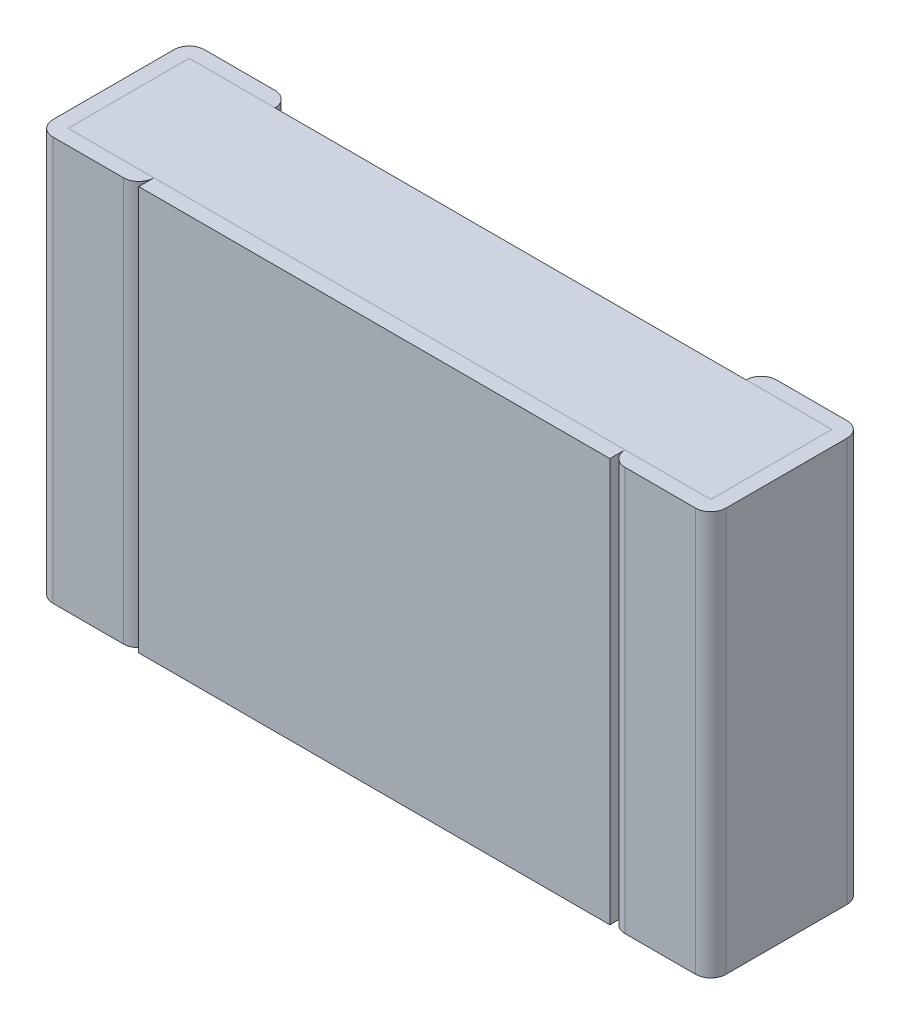
ISO-10303-21;
HEADER;
FILE_DESCRIPTION(('STEP AP214'),'2;1');
FILE_NAME('part.step','',(''),(''),'','','');
FILE_SCHEMA(('AUTOMOTIVE_DESIGN { 1 0 10303 214 1 1 1 1 }'));
ENDSEC;
DATA;
#1=APPLICATION_CONTEXT('core data for automotive mechanical design processes');
#2=APPLICATION_PROTOCOL_DEFINITION('international standard','automotive_design',2000,#1);
#3=PRODUCT_CONTEXT('',#1,'mechanical');
#4=PRODUCT('Part','Part','',(#3));
#5=PRODUCT_RELATED_PRODUCT_CATEGORY('part','',(#4));
#6=PRODUCT_DEFINITION_FORMATION('','',#4);
#7=PRODUCT_DEFINITION_CONTEXT('part definition',#1,'design');
#8=PRODUCT_DEFINITION('design','',#6,#7);
#9=PRODUCT_DEFINITION_SHAPE('','',#8);
#10=(LENGTH_UNIT() NAMED_UNIT(*) SI_UNIT(.MILLI.,.METRE.));
#11=(NAMED_UNIT(*) PLANE_ANGLE_UNIT() SI_UNIT($,.RADIAN.));
#12=(NAMED_UNIT(*) SI_UNIT($,.STERADIAN.) SOLID_ANGLE_UNIT());
#13=UNCERTAINTY_MEASURE_WITH_UNIT(LENGTH_MEASURE(1.E-05),#10,'distance_accuracy_value','');
#14=(GEOMETRIC_REPRESENTATION_CONTEXT(3) GLOBAL_UNCERTAINTY_ASSIGNED_CONTEXT((#13)) GLOBAL_UNIT_ASSIGNED_CONTEXT((#10,
#11,#12)) REPRESENTATION_CONTEXT('',''));
#15=CARTESIAN_POINT('',(0.,0.,0.));
#16=DIRECTION('',(0.,0.,1.));
#17=DIRECTION('',(1.,0.,0.));
#18=AXIS2_PLACEMENT_3D('',#15,#16,#17);
#19=CARTESIAN_POINT('',(-0.7,-0.6,0.45));
#20=DIRECTION('',(0.,0.,1.));
#21=DIRECTION('',(1.,0.,0.));
#22=AXIS2_PLACEMENT_3D('',#19,#20,#21);
#23=PLANE('',#22);
#24=DIRECTION('',(0.,1.,0.));
#25=VECTOR('',#24,1.);
#26=CARTESIAN_POINT('',(-0.7,-0.6,0.45));
#27=LINE('',#26,#25);
#28=CARTESIAN_POINT('',(-0.7,-0.6,0.45));
#29=VERTEX_POINT('',#28);
#30=CARTESIAN_POINT('',(-0.7,0.6,0.45));
#31=VERTEX_POINT('',#30);
#32=EDGE_CURVE('E359',#29,#31,#27,.T.);
#33=ORIENTED_EDGE('',*,*,#32,.F.);
#34=DIRECTION('',(1.,0.,0.));
#35=VECTOR('',#34,1.);
#36=CARTESIAN_POINT('',(-0.7,-0.6,0.45));
#37=LINE('',#36,#35);
#38=CARTESIAN_POINT('',(0.7,-0.6,0.45));
#39=VERTEX_POINT('',#38);
#40=EDGE_CURVE('E341',#29,#39,#37,.T.);
#41=ORIENTED_EDGE('',*,*,#40,.T.);
#42=DIRECTION('',(0.,1.,0.));
#43=VECTOR('',#42,1.);
#44=CARTESIAN_POINT('',(0.7,-0.6,0.45));
#45=LINE('',#44,#43);
#46=CARTESIAN_POINT('',(0.7,0.6,0.45));
#47=VERTEX_POINT('',#46);
#48=EDGE_CURVE('E11',#39,#47,#45,.T.);
#49=ORIENTED_EDGE('',*,*,#48,.T.);
#50=DIRECTION('',(1.,0.,0.));
#51=VECTOR('',#50,1.);
#52=CARTESIAN_POINT('',(-0.7,0.6,0.45));
#53=LINE('',#52,#51);
#54=EDGE_CURVE('E21',#31,#47,#53,.T.);
#55=ORIENTED_EDGE('',*,*,#54,.F.);
#56=EDGE_LOOP('',(#33,#41,#49,#55));
#57=FACE_BOUND('',#56,.T.);
#58=ADVANCED_FACE('F17',(#57),#23,.T.);
#59=CARTESIAN_POINT('',(0.7,-0.6,0.405));
#60=DIRECTION('',(1.,0.,0.));
#61=DIRECTION('',(0.,1.,0.));
#62=AXIS2_PLACEMENT_3D('',#59,#60,#61);
#63=PLANE('',#62);
#64=DIRECTION('',(0.,0.,1.));
#65=VECTOR('',#64,1.);
#66=CARTESIAN_POINT('',(0.7,-0.6,0.405));
#67=LINE('',#66,#65);
#68=CARTESIAN_POINT('',(0.7,-0.6,0.405));
#69=VERTEX_POINT('',#68);
#70=EDGE_CURVE('E304',#69,#39,#67,.T.);
#71=ORIENTED_EDGE('',*,*,#70,.F.);
#72=DIRECTION('',(0.,1.,0.));
#73=VECTOR('',#72,1.);
#74=CARTESIAN_POINT('',(0.7,-0.6,0.405));
#75=LINE('',#74,#73);
#76=CARTESIAN_POINT('',(0.7,0.6,0.405));
#77=VERTEX_POINT('',#76);
#78=EDGE_CURVE('E28',#69,#77,#75,.T.);
#79=ORIENTED_EDGE('',*,*,#78,.T.);
#80=DIRECTION('',(0.,0.,1.));
#81=VECTOR('',#80,1.);
#82=CARTESIAN_POINT('',(0.7,0.6,0.405));
#83=LINE('',#82,#81);
#84=EDGE_CURVE('E417',#77,#47,#83,.T.);
#85=ORIENTED_EDGE('',*,*,#84,.T.);
#86=ORIENTED_EDGE('',*,*,#48,.F.);
#87=EDGE_LOOP('',(#71,#79,#85,#86));
#88=FACE_BOUND('',#87,.T.);
#89=ADVANCED_FACE('F545',(#88),#63,.T.);
#90=CARTESIAN_POINT('',(0.745,-0.6,0.405));
#91=DIRECTION('',(0.,1.,0.));
#92=DIRECTION('',(-1.,0.,0.));
#93=AXIS2_PLACEMENT_3D('',#90,#91,#92);
#94=CYLINDRICAL_SURFACE('',#93,0.045);
#95=CARTESIAN_POINT('',(0.745,-0.6,0.405));
#96=DIRECTION('',(0.,1.,0.));
#97=DIRECTION('',(0.,0.,1.));
#98=AXIS2_PLACEMENT_3D('',#95,#96,#97);
#99=CIRCLE('',#98,0.045);
#100=CARTESIAN_POINT('',(0.745,-0.6,0.45));
#101=VERTEX_POINT('',#100);
#102=EDGE_CURVE('E298',#69,#101,#99,.T.);
#103=ORIENTED_EDGE('',*,*,#102,.T.);
#104=DIRECTION('',(0.,1.,0.));
#105=VECTOR('',#104,1.);
#106=CARTESIAN_POINT('',(0.745,-0.6,0.45));
#107=LINE('',#106,#105);
#108=CARTESIAN_POINT('',(0.745,0.6,0.45));
#109=VERTEX_POINT('',#108);
#110=EDGE_CURVE('E329',#101,#109,#107,.T.);
#111=ORIENTED_EDGE('',*,*,#110,.T.);
#112=CARTESIAN_POINT('',(0.745,0.6,0.405));
#113=DIRECTION('',(0.,1.,0.));
#114=DIRECTION('',(0.,0.,1.));
#115=AXIS2_PLACEMENT_3D('',#112,#113,#114);
#116=CIRCLE('',#115,0.045);
#117=EDGE_CURVE('E293',#77,#109,#116,.T.);
#118=ORIENTED_EDGE('',*,*,#117,.F.);
#119=ORIENTED_EDGE('',*,*,#78,.F.);
#120=EDGE_LOOP('',(#103,#111,#118,#119));
#121=FACE_BOUND('',#120,.T.);
#122=ADVANCED_FACE('F502',(#121),#94,.T.);
#123=CARTESIAN_POINT('',(0.7,-0.6,0.45));
#124=DIRECTION('',(0.,0.,1.));
#125=DIRECTION('',(1.,0.,0.));
#126=AXIS2_PLACEMENT_3D('',#123,#124,#125);
#127=PLANE('',#126);
#128=DIRECTION('',(1.,0.,0.));
#129=VECTOR('',#128,1.);
#130=CARTESIAN_POINT('',(0.7,0.6,0.45));
#131=LINE('',#130,#129);
#132=CARTESIAN_POINT('',(0.955,0.6,0.45));
#133=VERTEX_POINT('',#132);
#134=EDGE_CURVE('E289',#109,#133,#131,.T.);
#135=ORIENTED_EDGE('',*,*,#134,.F.);
#136=ORIENTED_EDGE('',*,*,#110,.F.);
#137=DIRECTION('',(1.,0.,0.));
#138=VECTOR('',#137,1.);
#139=CARTESIAN_POINT('',(0.7,-0.6,0.45));
#140=LINE('',#139,#138);
#141=CARTESIAN_POINT('',(0.955,-0.6,0.45));
#142=VERTEX_POINT('',#141);
#143=EDGE_CURVE('E294',#101,#142,#140,.T.);
#144=ORIENTED_EDGE('',*,*,#143,.T.);
#145=DIRECTION('',(0.,1.,0.));
#146=VECTOR('',#145,1.);
#147=CARTESIAN_POINT('',(0.955,-0.6,0.45));
#148=LINE('',#147,#146);
#149=EDGE_CURVE('E326',#142,#133,#148,.T.);
#150=ORIENTED_EDGE('',*,*,#149,.T.);
#151=EDGE_LOOP('',(#135,#136,#144,#150));
#152=FACE_BOUND('',#151,.T.);
#153=ADVANCED_FACE('F511',(#152),#127,.T.);
#154=CARTESIAN_POINT('',(0.955,-0.6,0.405));
#155=DIRECTION('',(0.,1.,0.));
#156=DIRECTION('',(1.,0.,0.));
#157=AXIS2_PLACEMENT_3D('',#154,#155,#156);
#158=CYLINDRICAL_SURFACE('',#157,0.045);
#159=DIRECTION('',(0.,1.,0.));
#160=VECTOR('',#159,1.);
#161=CARTESIAN_POINT('',(1.,-0.6,0.405));
#162=LINE('',#161,#160);
#163=CARTESIAN_POINT('',(1.,-0.6,0.405));
#164=VERTEX_POINT('',#163);
#165=CARTESIAN_POINT('',(1.,0.6,0.405));
#166=VERTEX_POINT('',#165);
#167=EDGE_CURVE('E330',#164,#166,#162,.T.);
#168=ORIENTED_EDGE('',*,*,#167,.T.);
#169=CARTESIAN_POINT('',(0.955,0.6,0.405));
#170=DIRECTION('',(0.,-1.,0.));
#171=DIRECTION('',(0.,0.,1.));
#172=AXIS2_PLACEMENT_3D('',#169,#170,#171);
#173=CIRCLE('',#172,0.045);
#174=EDGE_CURVE('E254',#166,#133,#173,.T.);
#175=ORIENTED_EDGE('',*,*,#174,.T.);
#176=ORIENTED_EDGE('',*,*,#149,.F.);
#177=CARTESIAN_POINT('',(0.955,-0.6,0.405));
#178=DIRECTION('',(0.,-1.,0.));
#179=DIRECTION('',(0.,0.,1.));
#180=AXIS2_PLACEMENT_3D('',#177,#178,#179);
#181=CIRCLE('',#180,0.045);
#182=EDGE_CURVE('E299',#164,#142,#181,.T.);
#183=ORIENTED_EDGE('',*,*,#182,.F.);
#184=EDGE_LOOP('',(#168,#175,#176,#183));
#185=FACE_BOUND('',#184,.T.);
#186=ADVANCED_FACE('F569',(#185),#158,.T.);
#187=CARTESIAN_POINT('',(1.,-0.6,0.));
#188=DIRECTION('',(1.,0.,0.));
#189=DIRECTION('',(0.,1.,0.));
#190=AXIS2_PLACEMENT_3D('',#187,#188,#189);
#191=PLANE('',#190);
#192=DIRECTION('',(0.,0.,1.));
#193=VECTOR('',#192,1.);
#194=CARTESIAN_POINT('',(1.,-0.6,0.));
#195=LINE('',#194,#193);
#196=CARTESIAN_POINT('',(1.,-0.6,0.045));
#197=VERTEX_POINT('',#196);
#198=EDGE_CURVE('E306',#197,#164,#195,.T.);
#199=ORIENTED_EDGE('',*,*,#198,.F.);
#200=DIRECTION('',(0.,1.,0.));
#201=VECTOR('',#200,1.);
#202=CARTESIAN_POINT('',(1.,-0.6,0.045));
#203=LINE('',#202,#201);
#204=CARTESIAN_POINT('',(1.,0.6,0.045));
#205=VERTEX_POINT('',#204);
#206=EDGE_CURVE('E348',#197,#205,#203,.T.);
#207=ORIENTED_EDGE('',*,*,#206,.T.);
#208=DIRECTION('',(0.,0.,1.));
#209=VECTOR('',#208,1.);
#210=CARTESIAN_POINT('',(1.,0.6,0.));
#211=LINE('',#210,#209);
#212=EDGE_CURVE('E250',#205,#166,#211,.T.);
#213=ORIENTED_EDGE('',*,*,#212,.T.);
#214=ORIENTED_EDGE('',*,*,#167,.F.);
#215=EDGE_LOOP('',(#199,#207,#213,#214));
#216=FACE_BOUND('',#215,.T.);
#217=ADVANCED_FACE('F566',(#216),#191,.T.);
#218=CARTESIAN_POINT('',(0.955,-0.6,0.045));
#219=DIRECTION('',(0.,1.,0.));
#220=DIRECTION('',(1.,0.,0.));
#221=AXIS2_PLACEMENT_3D('',#218,#219,#220);
#222=CYLINDRICAL_SURFACE('',#221,0.045);
#223=CARTESIAN_POINT('',(0.955,-0.6,0.045));
#224=DIRECTION('',(0.,1.,0.));
#225=DIRECTION('',(0.,0.,1.));
#226=AXIS2_PLACEMENT_3D('',#223,#224,#225);
#227=CIRCLE('',#226,0.045);
#228=CARTESIAN_POINT('',(0.955,-0.6,0.));
#229=VERTEX_POINT('',#228);
#230=EDGE_CURVE('E310',#197,#229,#227,.T.);
#231=ORIENTED_EDGE('',*,*,#230,.T.);
#232=DIRECTION('',(0.,1.,0.));
#233=VECTOR('',#232,1.);
#234=CARTESIAN_POINT('',(0.955,-0.6,0.));
#235=LINE('',#234,#233);
#236=CARTESIAN_POINT('',(0.955,0.6,0.));
#237=VERTEX_POINT('',#236);
#238=EDGE_CURVE('E345',#229,#237,#235,.T.);
#239=ORIENTED_EDGE('',*,*,#238,.T.);
#240=CARTESIAN_POINT('',(0.955,0.6,0.045));
#241=DIRECTION('',(0.,1.,0.));
#242=DIRECTION('',(0.,0.,1.));
#243=AXIS2_PLACEMENT_3D('',#240,#241,#242);
#244=CIRCLE('',#243,0.045);
#245=EDGE_CURVE('E253',#205,#237,#244,.T.);
#246=ORIENTED_EDGE('',*,*,#245,.F.);
#247=ORIENTED_EDGE('',*,*,#206,.F.);
#248=EDGE_LOOP('',(#231,#239,#246,#247));
#249=FACE_BOUND('',#248,.T.);
#250=ADVANCED_FACE('F530',(#249),#222,.T.);
#251=CARTESIAN_POINT('',(0.7,-0.6,0.));
#252=DIRECTION('',(0.,0.,1.));
#253=DIRECTION('',(1.,0.,0.));
#254=AXIS2_PLACEMENT_3D('',#251,#252,#253);
#255=PLANE('',#254);
#256=ORIENTED_EDGE('',*,*,#238,.F.);
#257=DIRECTION('',(1.,0.,0.));
#258=VECTOR('',#257,1.);
#259=CARTESIAN_POINT('',(0.7,-0.6,0.));
#260=LINE('',#259,#258);
#261=CARTESIAN_POINT('',(0.745,-0.6,0.));
#262=VERTEX_POINT('',#261);
#263=EDGE_CURVE('E300',#262,#229,#260,.T.);
#264=ORIENTED_EDGE('',*,*,#263,.F.);
#265=DIRECTION('',(0.,1.,0.));
#266=VECTOR('',#265,1.);
#267=CARTESIAN_POINT('',(0.745,-0.6,0.));
#268=LINE('',#267,#266);
#269=CARTESIAN_POINT('',(0.745,0.6,0.));
#270=VERTEX_POINT('',#269);
#271=EDGE_CURVE('E349',#262,#270,#268,.T.);
#272=ORIENTED_EDGE('',*,*,#271,.T.);
#273=DIRECTION('',(1.,0.,0.));
#274=VECTOR('',#273,1.);
#275=CARTESIAN_POINT('',(0.7,0.6,0.));
#276=LINE('',#275,#274);
#277=EDGE_CURVE('E358',#270,#237,#276,.T.);
#278=ORIENTED_EDGE('',*,*,#277,.T.);
#279=EDGE_LOOP('',(#256,#264,#272,#278));
#280=FACE_BOUND('',#279,.T.);
#281=ADVANCED_FACE('F525',(#280),#255,.F.);
#282=CARTESIAN_POINT('',(0.745,-0.6,0.045));
#283=DIRECTION('',(0.,1.,0.));
#284=DIRECTION('',(-1.,0.,0.));
#285=AXIS2_PLACEMENT_3D('',#282,#283,#284);
#286=CYLINDRICAL_SURFACE('',#285,0.045);
#287=DIRECTION('',(0.,1.,0.));
#288=VECTOR('',#287,1.);
#289=CARTESIAN_POINT('',(0.7,-0.6,0.045));
#290=LINE('',#289,#288);
#291=CARTESIAN_POINT('',(0.7,-0.6,0.045));
#292=VERTEX_POINT('',#291);
#293=CARTESIAN_POINT('',(0.7,0.6,0.045));
#294=VERTEX_POINT('',#293);
#295=EDGE_CURVE('E414',#292,#294,#290,.T.);
#296=ORIENTED_EDGE('',*,*,#295,.T.);
#297=CARTESIAN_POINT('',(0.745,0.6,0.045));
#298=DIRECTION('',(0.,-1.,0.));
#299=DIRECTION('',(0.,0.,1.));
#300=AXIS2_PLACEMENT_3D('',#297,#298,#299);
#301=CIRCLE('',#300,0.045);
#302=EDGE_CURVE('E322',#294,#270,#301,.T.);
#303=ORIENTED_EDGE('',*,*,#302,.T.);
#304=ORIENTED_EDGE('',*,*,#271,.F.);
#305=CARTESIAN_POINT('',(0.745,-0.6,0.045));
#306=DIRECTION('',(0.,-1.,0.));
#307=DIRECTION('',(0.,0.,1.));
#308=AXIS2_PLACEMENT_3D('',#305,#306,#307);
#309=CIRCLE('',#308,0.045);
#310=EDGE_CURVE('E305',#292,#262,#309,.T.);
#311=ORIENTED_EDGE('',*,*,#310,.F.);
#312=EDGE_LOOP('',(#296,#303,#304,#311));
#313=FACE_BOUND('',#312,.T.);
#314=ADVANCED_FACE('F19',(#313),#286,.T.);
#315=CARTESIAN_POINT('',(-0.7,0.6,0.405));
#316=DIRECTION('',(0.,1.,0.));
#317=DIRECTION('',(1.,0.,0.));
#318=AXIS2_PLACEMENT_3D('',#315,#316,#317);
#319=PLANE('',#318);
#320=DIRECTION('',(1.,0.,0.));
#321=VECTOR('',#320,1.);
#322=CARTESIAN_POINT('',(-0.7,0.6,0.405));
#323=LINE('',#322,#321);
#324=CARTESIAN_POINT('',(-0.7,0.6,0.405));
#325=VERTEX_POINT('',#324);
#326=EDGE_CURVE('E370',#325,#77,#323,.T.);
#327=ORIENTED_EDGE('',*,*,#326,.F.);
#328=DIRECTION('',(0.,0.,1.));
#329=VECTOR('',#328,1.);
#330=CARTESIAN_POINT('',(-0.7,0.6,0.405));
#331=LINE('',#330,#329);
#332=EDGE_CURVE('E354',#325,#31,#331,.T.);
#333=ORIENTED_EDGE('',*,*,#332,.T.);
#334=ORIENTED_EDGE('',*,*,#54,.T.);
#335=ORIENTED_EDGE('',*,*,#84,.F.);
#336=EDGE_LOOP('',(#327,#333,#334,#335));
#337=FACE_BOUND('',#336,.T.);
#338=ADVANCED_FACE('F448',(#337),#319,.T.);
#339=CARTESIAN_POINT('',(0.7,0.6,0.));
#340=DIRECTION('',(0.,1.,0.));
#341=DIRECTION('',(1.,0.,0.));
#342=AXIS2_PLACEMENT_3D('',#339,#340,#341);
#343=PLANE('',#342);
#344=ORIENTED_EDGE('',*,*,#277,.F.);
#345=ORIENTED_EDGE('',*,*,#302,.F.);
#346=DIRECTION('',(1.,0.,0.));
#347=VECTOR('',#346,1.);
#348=CARTESIAN_POINT('',(-0.955,0.6,0.045));
#349=LINE('',#348,#347);
#350=CARTESIAN_POINT('',(0.955,0.6,0.045));
#351=VERTEX_POINT('',#350);
#352=EDGE_CURVE('E261',#294,#351,#349,.T.);
#353=ORIENTED_EDGE('',*,*,#352,.T.);
#354=DIRECTION('',(0.,0.,1.));
#355=VECTOR('',#354,1.);
#356=CARTESIAN_POINT('',(0.955,0.6,0.045));
#357=LINE('',#356,#355);
#358=CARTESIAN_POINT('',(0.955,0.6,0.405));
#359=VERTEX_POINT('',#358);
#360=EDGE_CURVE('E265',#351,#359,#357,.T.);
#361=ORIENTED_EDGE('',*,*,#360,.T.);
#362=DIRECTION('',(1.,0.,0.));
#363=VECTOR('',#362,1.);
#364=CARTESIAN_POINT('',(-0.955,0.6,0.405));
#365=LINE('',#364,#363);
#366=EDGE_CURVE('E397',#77,#359,#365,.T.);
#367=ORIENTED_EDGE('',*,*,#366,.F.);
#368=ORIENTED_EDGE('',*,*,#117,.T.);
#369=ORIENTED_EDGE('',*,*,#134,.T.);
#370=ORIENTED_EDGE('',*,*,#174,.F.);
#371=ORIENTED_EDGE('',*,*,#212,.F.);
#372=ORIENTED_EDGE('',*,*,#245,.T.);
#373=EDGE_LOOP('',(#344,#345,#353,#361,#367,#368,#369,#370,#371,#372));
#374=FACE_BOUND('',#373,.T.);
#375=ADVANCED_FACE('F515',(#374),#343,.T.);
#376=CARTESIAN_POINT('',(-0.7,-0.6,0.405));
#377=DIRECTION('',(1.,0.,0.));
#378=DIRECTION('',(0.,1.,0.));
#379=AXIS2_PLACEMENT_3D('',#376,#377,#378);
#380=PLANE('',#379);
#381=ORIENTED_EDGE('',*,*,#32,.T.);
#382=ORIENTED_EDGE('',*,*,#332,.F.);
#383=DIRECTION('',(0.,1.,0.));
#384=VECTOR('',#383,1.);
#385=CARTESIAN_POINT('',(-0.7,-0.6,0.405));
#386=LINE('',#385,#384);
#387=CARTESIAN_POINT('',(-0.7,-0.6,0.405));
#388=VERTEX_POINT('',#387);
#389=EDGE_CURVE('E220',#388,#325,#386,.T.);
#390=ORIENTED_EDGE('',*,*,#389,.F.);
#391=DIRECTION('',(0.,0.,1.));
#392=VECTOR('',#391,1.);
#393=CARTESIAN_POINT('',(-0.7,-0.6,0.405));
#394=LINE('',#393,#392);
#395=EDGE_CURVE('E344',#388,#29,#394,.T.);
#396=ORIENTED_EDGE('',*,*,#395,.T.);
#397=EDGE_LOOP('',(#381,#382,#390,#396));
#398=FACE_BOUND('',#397,.T.);
#399=ADVANCED_FACE('F442',(#398),#380,.F.);
#400=CARTESIAN_POINT('',(-0.7,-0.6,0.405));
#401=DIRECTION('',(0.,1.,0.));
#402=DIRECTION('',(1.,0.,0.));
#403=AXIS2_PLACEMENT_3D('',#400,#401,#402);
#404=PLANE('',#403);
#405=ORIENTED_EDGE('',*,*,#70,.T.);
#406=ORIENTED_EDGE('',*,*,#40,.F.);
#407=ORIENTED_EDGE('',*,*,#395,.F.);
#408=DIRECTION('',(1.,0.,0.));
#409=VECTOR('',#408,1.);
#410=CARTESIAN_POINT('',(-0.7,-0.6,0.405));
#411=LINE('',#410,#409);
#412=EDGE_CURVE('E221',#388,#69,#411,.T.);
#413=ORIENTED_EDGE('',*,*,#412,.T.);
#414=EDGE_LOOP('',(#405,#406,#407,#413));
#415=FACE_BOUND('',#414,.T.);
#416=ADVANCED_FACE('F559',(#415),#404,.F.);
#417=CARTESIAN_POINT('',(0.7,-0.6,0.));
#418=DIRECTION('',(0.,1.,0.));
#419=DIRECTION('',(1.,0.,0.));
#420=AXIS2_PLACEMENT_3D('',#417,#418,#419);
#421=PLANE('',#420);
#422=ORIENTED_EDGE('',*,*,#230,.F.);
#423=ORIENTED_EDGE('',*,*,#198,.T.);
#424=ORIENTED_EDGE('',*,*,#182,.T.);
#425=ORIENTED_EDGE('',*,*,#143,.F.);
#426=ORIENTED_EDGE('',*,*,#102,.F.);
#427=DIRECTION('',(1.,0.,0.));
#428=VECTOR('',#427,1.);
#429=CARTESIAN_POINT('',(-0.955,-0.6,0.405));
#430=LINE('',#429,#428);
#431=CARTESIAN_POINT('',(0.955,-0.6,0.405));
#432=VERTEX_POINT('',#431);
#433=EDGE_CURVE('E394',#69,#432,#430,.T.);
#434=ORIENTED_EDGE('',*,*,#433,.T.);
#435=DIRECTION('',(0.,0.,1.));
#436=VECTOR('',#435,1.);
#437=CARTESIAN_POINT('',(0.955,-0.6,0.045));
#438=LINE('',#437,#436);
#439=CARTESIAN_POINT('',(0.955,-0.6,0.045));
#440=VERTEX_POINT('',#439);
#441=EDGE_CURVE('E390',#440,#432,#438,.T.);
#442=ORIENTED_EDGE('',*,*,#441,.F.);
#443=DIRECTION('',(1.,0.,0.));
#444=VECTOR('',#443,1.);
#445=CARTESIAN_POINT('',(-0.955,-0.6,0.045));
#446=LINE('',#445,#444);
#447=EDGE_CURVE('E335',#292,#440,#446,.T.);
#448=ORIENTED_EDGE('',*,*,#447,.F.);
#449=ORIENTED_EDGE('',*,*,#310,.T.);
#450=ORIENTED_EDGE('',*,*,#263,.T.);
#451=EDGE_LOOP('',(#422,#423,#424,#425,#426,#434,#442,#448,#449,#450));
#452=FACE_BOUND('',#451,.T.);
#453=ADVANCED_FACE('F508',(#452),#421,.F.);
#454=CARTESIAN_POINT('',(-0.955,-0.6,0.045));
#455=DIRECTION('',(0.,0.,1.));
#456=DIRECTION('',(1.,0.,0.));
#457=AXIS2_PLACEMENT_3D('',#454,#455,#456);
#458=PLANE('',#457);
#459=DIRECTION('',(1.,0.,0.));
#460=VECTOR('',#459,1.);
#461=CARTESIAN_POINT('',(-0.955,0.6,0.045));
#462=LINE('',#461,#460);
#463=CARTESIAN_POINT('',(-0.7,0.6,0.045));
#464=VERTEX_POINT('',#463);
#465=EDGE_CURVE('E264',#464,#294,#462,.T.);
#466=ORIENTED_EDGE('',*,*,#465,.T.);
#467=ORIENTED_EDGE('',*,*,#295,.F.);
#468=DIRECTION('',(1.,0.,0.));
#469=VECTOR('',#468,1.);
#470=CARTESIAN_POINT('',(-0.955,-0.6,0.045));
#471=LINE('',#470,#469);
#472=CARTESIAN_POINT('',(-0.7,-0.6,0.045));
#473=VERTEX_POINT('',#472);
#474=EDGE_CURVE('E331',#473,#292,#471,.T.);
#475=ORIENTED_EDGE('',*,*,#474,.F.);
#476=DIRECTION('',(0.,1.,0.));
#477=VECTOR('',#476,1.);
#478=CARTESIAN_POINT('',(-0.7,-0.6,0.045));
#479=LINE('',#478,#477);
#480=EDGE_CURVE('E336',#473,#464,#479,.T.);
#481=ORIENTED_EDGE('',*,*,#480,.T.);
#482=EDGE_LOOP('',(#466,#467,#475,#481));
#483=FACE_BOUND('',#482,.T.);
#484=ADVANCED_FACE('F462',(#483),#458,.F.);
#485=CARTESIAN_POINT('',(-0.955,0.6,0.045));
#486=DIRECTION('',(0.,1.,0.));
#487=DIRECTION('',(1.,0.,0.));
#488=AXIS2_PLACEMENT_3D('',#485,#486,#487);
#489=PLANE('',#488);
#490=DIRECTION('',(1.,0.,0.));
#491=VECTOR('',#490,1.);
#492=CARTESIAN_POINT('',(-0.955,0.6,0.045));
#493=LINE('',#492,#491);
#494=CARTESIAN_POINT('',(-0.955,0.6,0.045));
#495=VERTEX_POINT('',#494);
#496=EDGE_CURVE('E275',#495,#464,#493,.T.);
#497=ORIENTED_EDGE('',*,*,#496,.F.);
#498=DIRECTION('',(0.,0.,1.));
#499=VECTOR('',#498,1.);
#500=CARTESIAN_POINT('',(-0.955,0.6,0.045));
#501=LINE('',#500,#499);
#502=CARTESIAN_POINT('',(-0.955,0.6,0.405));
#503=VERTEX_POINT('',#502);
#504=EDGE_CURVE('E363',#495,#503,#501,.T.);
#505=ORIENTED_EDGE('',*,*,#504,.T.);
#506=DIRECTION('',(1.,0.,0.));
#507=VECTOR('',#506,1.);
#508=CARTESIAN_POINT('',(-0.955,0.6,0.405));
#509=LINE('',#508,#507);
#510=EDGE_CURVE('E232',#503,#325,#509,.T.);
#511=ORIENTED_EDGE('',*,*,#510,.T.);
#512=ORIENTED_EDGE('',*,*,#326,.T.);
#513=ORIENTED_EDGE('',*,*,#366,.T.);
#514=ORIENTED_EDGE('',*,*,#360,.F.);
#515=ORIENTED_EDGE('',*,*,#352,.F.);
#516=ORIENTED_EDGE('',*,*,#465,.F.);
#517=EDGE_LOOP('',(#497,#505,#511,#512,#513,#514,#515,#516));
#518=FACE_BOUND('',#517,.T.);
#519=ADVANCED_FACE('F452',(#518),#489,.T.);
#520=CARTESIAN_POINT('',(-0.745,-0.6,0.405));
#521=DIRECTION('',(0.,1.,0.));
#522=DIRECTION('',(1.,0.,0.));
#523=AXIS2_PLACEMENT_3D('',#520,#521,#522);
#524=CYLINDRICAL_SURFACE('',#523,0.045);
#525=ORIENTED_EDGE('',*,*,#389,.T.);
#526=CARTESIAN_POINT('',(-0.745,0.6,0.405));
#527=DIRECTION('',(0.,-1.,0.));
#528=DIRECTION('',(0.,0.,1.));
#529=AXIS2_PLACEMENT_3D('',#526,#527,#528);
#530=CIRCLE('',#529,0.045);
#531=CARTESIAN_POINT('',(-0.745,0.6,0.45));
#532=VERTEX_POINT('',#531);
#533=EDGE_CURVE('E225',#325,#532,#530,.T.);
#534=ORIENTED_EDGE('',*,*,#533,.T.);
#535=DIRECTION('',(0.,1.,0.));
#536=VECTOR('',#535,1.);
#537=CARTESIAN_POINT('',(-0.745,-0.6,0.45));
#538=LINE('',#537,#536);
#539=CARTESIAN_POINT('',(-0.745,-0.6,0.45));
#540=VERTEX_POINT('',#539);
#541=EDGE_CURVE('E208',#540,#532,#538,.T.);
#542=ORIENTED_EDGE('',*,*,#541,.F.);
#543=CARTESIAN_POINT('',(-0.745,-0.6,0.405));
#544=DIRECTION('',(0.,-1.,0.));
#545=DIRECTION('',(0.,0.,1.));
#546=AXIS2_PLACEMENT_3D('',#543,#544,#545);
#547=CIRCLE('',#546,0.045);
#548=EDGE_CURVE('E353',#388,#540,#547,.T.);
#549=ORIENTED_EDGE('',*,*,#548,.F.);
#550=EDGE_LOOP('',(#525,#534,#542,#549));
#551=FACE_BOUND('',#550,.T.);
#552=ADVANCED_FACE('F226',(#551),#524,.T.);
#553=CARTESIAN_POINT('',(-1.,-0.6,0.45));
#554=DIRECTION('',(0.,0.,1.));
#555=DIRECTION('',(1.,0.,0.));
#556=AXIS2_PLACEMENT_3D('',#553,#554,#555);
#557=PLANE('',#556);
#558=DIRECTION('',(1.,0.,0.));
#559=VECTOR('',#558,1.);
#560=CARTESIAN_POINT('',(-1.,0.6,0.45));
#561=LINE('',#560,#559);
#562=CARTESIAN_POINT('',(-0.955,0.6,0.45));
#563=VERTEX_POINT('',#562);
#564=EDGE_CURVE('E212',#563,#532,#561,.T.);
#565=ORIENTED_EDGE('',*,*,#564,.F.);
#566=DIRECTION('',(0.,1.,0.));
#567=VECTOR('',#566,1.);
#568=CARTESIAN_POINT('',(-0.955,-0.6,0.45));
#569=LINE('',#568,#567);
#570=CARTESIAN_POINT('',(-0.955,-0.6,0.45));
#571=VERTEX_POINT('',#570);
#572=EDGE_CURVE('E266',#571,#563,#569,.T.);
#573=ORIENTED_EDGE('',*,*,#572,.F.);
#574=DIRECTION('',(1.,0.,0.));
#575=VECTOR('',#574,1.);
#576=CARTESIAN_POINT('',(-1.,-0.6,0.45));
#577=LINE('',#576,#575);
#578=EDGE_CURVE('E215',#571,#540,#577,.T.);
#579=ORIENTED_EDGE('',*,*,#578,.T.);
#580=ORIENTED_EDGE('',*,*,#541,.T.);
#581=EDGE_LOOP('',(#565,#573,#579,#580));
#582=FACE_BOUND('',#581,.T.);
#583=ADVANCED_FACE('F210',(#582),#557,.T.);
#584=CARTESIAN_POINT('',(-0.955,-0.6,0.045));
#585=DIRECTION('',(0.,1.,0.));
#586=DIRECTION('',(1.,0.,0.));
#587=AXIS2_PLACEMENT_3D('',#584,#585,#586);
#588=PLANE('',#587);
#589=ORIENTED_EDGE('',*,*,#474,.T.);
#590=ORIENTED_EDGE('',*,*,#447,.T.);
#591=ORIENTED_EDGE('',*,*,#441,.T.);
#592=ORIENTED_EDGE('',*,*,#433,.F.);
#593=ORIENTED_EDGE('',*,*,#412,.F.);
#594=DIRECTION('',(1.,0.,0.));
#595=VECTOR('',#594,1.);
#596=CARTESIAN_POINT('',(-0.955,-0.6,0.405));
#597=LINE('',#596,#595);
#598=CARTESIAN_POINT('',(-0.955,-0.6,0.405));
#599=VERTEX_POINT('',#598);
#600=EDGE_CURVE('E259',#599,#388,#597,.T.);
#601=ORIENTED_EDGE('',*,*,#600,.F.);
#602=DIRECTION('',(0.,0.,1.));
#603=VECTOR('',#602,1.);
#604=CARTESIAN_POINT('',(-0.955,-0.6,0.045));
#605=LINE('',#604,#603);
#606=CARTESIAN_POINT('',(-0.955,-0.6,0.045));
#607=VERTEX_POINT('',#606);
#608=EDGE_CURVE('E255',#607,#599,#605,.T.);
#609=ORIENTED_EDGE('',*,*,#608,.F.);
#610=DIRECTION('',(1.,0.,0.));
#611=VECTOR('',#610,1.);
#612=CARTESIAN_POINT('',(-0.955,-0.6,0.045));
#613=LINE('',#612,#611);
#614=EDGE_CURVE('E260',#607,#473,#613,.T.);
#615=ORIENTED_EDGE('',*,*,#614,.T.);
#616=EDGE_LOOP('',(#589,#590,#591,#592,#593,#601,#609,#615));
#617=FACE_BOUND('',#616,.T.);
#618=ADVANCED_FACE('F555',(#617),#588,.F.);
#619=CARTESIAN_POINT('',(-0.745,-0.6,0.045));
#620=DIRECTION('',(0.,1.,0.));
#621=DIRECTION('',(1.,0.,0.));
#622=AXIS2_PLACEMENT_3D('',#619,#620,#621);
#623=CYLINDRICAL_SURFACE('',#622,0.045);
#624=CARTESIAN_POINT('',(-0.745,-0.6,0.045));
#625=DIRECTION('',(0.,1.,0.));
#626=DIRECTION('',(0.,0.,1.));
#627=AXIS2_PLACEMENT_3D('',#624,#625,#626);
#628=CIRCLE('',#627,0.045);
#629=CARTESIAN_POINT('',(-0.745,-0.6,0.));
#630=VERTEX_POINT('',#629);
#631=EDGE_CURVE('E340',#473,#630,#628,.T.);
#632=ORIENTED_EDGE('',*,*,#631,.T.);
#633=DIRECTION('',(0.,1.,0.));
#634=VECTOR('',#633,1.);
#635=CARTESIAN_POINT('',(-0.745,-0.6,0.));
#636=LINE('',#635,#634);
#637=CARTESIAN_POINT('',(-0.745,0.6,0.));
#638=VERTEX_POINT('',#637);
#639=EDGE_CURVE('E274',#630,#638,#636,.T.);
#640=ORIENTED_EDGE('',*,*,#639,.T.);
#641=CARTESIAN_POINT('',(-0.745,0.6,0.045));
#642=DIRECTION('',(0.,1.,0.));
#643=DIRECTION('',(0.,0.,1.));
#644=AXIS2_PLACEMENT_3D('',#641,#642,#643);
#645=CIRCLE('',#644,0.045);
#646=EDGE_CURVE('E270',#464,#638,#645,.T.);
#647=ORIENTED_EDGE('',*,*,#646,.F.);
#648=ORIENTED_EDGE('',*,*,#480,.F.);
#649=EDGE_LOOP('',(#632,#640,#647,#648));
#650=FACE_BOUND('',#649,.T.);
#651=ADVANCED_FACE('F466',(#650),#623,.T.);
#652=CARTESIAN_POINT('',(-1.,-0.6,0.));
#653=DIRECTION('',(0.,0.,1.));
#654=DIRECTION('',(1.,0.,0.));
#655=AXIS2_PLACEMENT_3D('',#652,#653,#654);
#656=PLANE('',#655);
#657=ORIENTED_EDGE('',*,*,#639,.F.);
#658=DIRECTION('',(1.,0.,0.));
#659=VECTOR('',#658,1.);
#660=CARTESIAN_POINT('',(-1.,-0.6,0.));
#661=LINE('',#660,#659);
#662=CARTESIAN_POINT('',(-0.955,-0.6,0.));
#663=VERTEX_POINT('',#662);
#664=EDGE_CURVE('E279',#663,#630,#661,.T.);
#665=ORIENTED_EDGE('',*,*,#664,.F.);
#666=DIRECTION('',(0.,1.,0.));
#667=VECTOR('',#666,1.);
#668=CARTESIAN_POINT('',(-0.955,-0.6,0.));
#669=LINE('',#668,#667);
#670=CARTESIAN_POINT('',(-0.955,0.6,0.));
#671=VERTEX_POINT('',#670);
#672=EDGE_CURVE('E269',#663,#671,#669,.T.);
#673=ORIENTED_EDGE('',*,*,#672,.T.);
#674=DIRECTION('',(1.,0.,0.));
#675=VECTOR('',#674,1.);
#676=CARTESIAN_POINT('',(-1.,0.6,0.));
#677=LINE('',#676,#675);
#678=EDGE_CURVE('E239',#671,#638,#677,.T.);
#679=ORIENTED_EDGE('',*,*,#678,.T.);
#680=EDGE_LOOP('',(#657,#665,#673,#679));
#681=FACE_BOUND('',#680,.T.);
#682=ADVANCED_FACE('F470',(#681),#656,.F.);
#683=CARTESIAN_POINT('',(-1.,0.6,0.));
#684=DIRECTION('',(0.,1.,0.));
#685=DIRECTION('',(1.,0.,0.));
#686=AXIS2_PLACEMENT_3D('',#683,#684,#685);
#687=PLANE('',#686);
#688=ORIENTED_EDGE('',*,*,#678,.F.);
#689=CARTESIAN_POINT('',(-0.955,0.6,0.045));
#690=DIRECTION('',(0.,-1.,0.));
#691=DIRECTION('',(0.,0.,1.));
#692=AXIS2_PLACEMENT_3D('',#689,#690,#691);
#693=CIRCLE('',#692,0.045);
#694=CARTESIAN_POINT('',(-1.,0.6,0.045));
#695=VERTEX_POINT('',#694);
#696=EDGE_CURVE('E283',#695,#671,#693,.T.);
#697=ORIENTED_EDGE('',*,*,#696,.F.);
#698=DIRECTION('',(0.,0.,1.));
#699=VECTOR('',#698,1.);
#700=CARTESIAN_POINT('',(-1.,0.6,0.));
#701=LINE('',#700,#699);
#702=CARTESIAN_POINT('',(-1.,0.6,0.405));
#703=VERTEX_POINT('',#702);
#704=EDGE_CURVE('E314',#695,#703,#701,.T.);
#705=ORIENTED_EDGE('',*,*,#704,.T.);
#706=CARTESIAN_POINT('',(-0.955,0.6,0.405));
#707=DIRECTION('',(0.,1.,0.));
#708=DIRECTION('',(0.,0.,1.));
#709=AXIS2_PLACEMENT_3D('',#706,#707,#708);
#710=CIRCLE('',#709,0.045);
#711=EDGE_CURVE('E236',#703,#563,#710,.T.);
#712=ORIENTED_EDGE('',*,*,#711,.T.);
#713=ORIENTED_EDGE('',*,*,#564,.T.);
#714=ORIENTED_EDGE('',*,*,#533,.F.);
#715=ORIENTED_EDGE('',*,*,#510,.F.);
#716=ORIENTED_EDGE('',*,*,#504,.F.);
#717=ORIENTED_EDGE('',*,*,#496,.T.);
#718=ORIENTED_EDGE('',*,*,#646,.T.);
#719=EDGE_LOOP('',(#688,#697,#705,#712,#713,#714,#715,#716,#717,#718));
#720=FACE_BOUND('',#719,.T.);
#721=ADVANCED_FACE('F234',(#720),#687,.T.);
#722=CARTESIAN_POINT('',(-0.955,-0.6,0.405));
#723=DIRECTION('',(0.,1.,0.));
#724=DIRECTION('',(-1.,0.,0.));
#725=AXIS2_PLACEMENT_3D('',#722,#723,#724);
#726=CYLINDRICAL_SURFACE('',#725,0.045);
#727=CARTESIAN_POINT('',(-0.955,-0.6,0.405));
#728=DIRECTION('',(0.,1.,0.));
#729=DIRECTION('',(0.,0.,1.));
#730=AXIS2_PLACEMENT_3D('',#727,#728,#729);
#731=CIRCLE('',#730,0.045);
#732=CARTESIAN_POINT('',(-1.,-0.6,0.405));
#733=VERTEX_POINT('',#732);
#734=EDGE_CURVE('E285',#733,#571,#731,.T.);
#735=ORIENTED_EDGE('',*,*,#734,.T.);
#736=ORIENTED_EDGE('',*,*,#572,.T.);
#737=ORIENTED_EDGE('',*,*,#711,.F.);
#738=DIRECTION('',(0.,1.,0.));
#739=VECTOR('',#738,1.);
#740=CARTESIAN_POINT('',(-1.,-0.6,0.405));
#741=LINE('',#740,#739);
#742=EDGE_CURVE('E317',#733,#703,#741,.T.);
#743=ORIENTED_EDGE('',*,*,#742,.F.);
#744=EDGE_LOOP('',(#735,#736,#737,#743));
#745=FACE_BOUND('',#744,.T.);
#746=ADVANCED_FACE('F484',(#745),#726,.T.);
#747=CARTESIAN_POINT('',(-0.955,-0.6,0.045));
#748=DIRECTION('',(0.,1.,0.));
#749=DIRECTION('',(-1.,0.,0.));
#750=AXIS2_PLACEMENT_3D('',#747,#748,#749);
#751=CYLINDRICAL_SURFACE('',#750,0.045);
#752=DIRECTION('',(0.,1.,0.));
#753=VECTOR('',#752,1.);
#754=CARTESIAN_POINT('',(-1.,-0.6,0.045));
#755=LINE('',#754,#753);
#756=CARTESIAN_POINT('',(-1.,-0.6,0.045));
#757=VERTEX_POINT('',#756);
#758=EDGE_CURVE('E316',#757,#695,#755,.T.);
#759=ORIENTED_EDGE('',*,*,#758,.T.);
#760=ORIENTED_EDGE('',*,*,#696,.T.);
#761=ORIENTED_EDGE('',*,*,#672,.F.);
#762=CARTESIAN_POINT('',(-0.955,-0.6,0.045));
#763=DIRECTION('',(0.,-1.,0.));
#764=DIRECTION('',(0.,0.,1.));
#765=AXIS2_PLACEMENT_3D('',#762,#763,#764);
#766=CIRCLE('',#765,0.045);
#767=EDGE_CURVE('E284',#757,#663,#766,.T.);
#768=ORIENTED_EDGE('',*,*,#767,.F.);
#769=EDGE_LOOP('',(#759,#760,#761,#768));
#770=FACE_BOUND('',#769,.T.);
#771=ADVANCED_FACE('F478',(#770),#751,.T.);
#772=CARTESIAN_POINT('',(-1.,-0.6,0.));
#773=DIRECTION('',(0.,1.,0.));
#774=DIRECTION('',(1.,0.,0.));
#775=AXIS2_PLACEMENT_3D('',#772,#773,#774);
#776=PLANE('',#775);
#777=ORIENTED_EDGE('',*,*,#631,.F.);
#778=ORIENTED_EDGE('',*,*,#614,.F.);
#779=ORIENTED_EDGE('',*,*,#608,.T.);
#780=ORIENTED_EDGE('',*,*,#600,.T.);
#781=ORIENTED_EDGE('',*,*,#548,.T.);
#782=ORIENTED_EDGE('',*,*,#578,.F.);
#783=ORIENTED_EDGE('',*,*,#734,.F.);
#784=DIRECTION('',(0.,0.,1.));
#785=VECTOR('',#784,1.);
#786=CARTESIAN_POINT('',(-1.,-0.6,0.));
#787=LINE('',#786,#785);
#788=EDGE_CURVE('E381',#757,#733,#787,.T.);
#789=ORIENTED_EDGE('',*,*,#788,.F.);
#790=ORIENTED_EDGE('',*,*,#767,.T.);
#791=ORIENTED_EDGE('',*,*,#664,.T.);
#792=EDGE_LOOP('',(#777,#778,#779,#780,#781,#782,#783,#789,#790,#791));
#793=FACE_BOUND('',#792,.T.);
#794=ADVANCED_FACE('F472',(#793),#776,.F.);
#795=CARTESIAN_POINT('',(-1.,-0.6,0.));
#796=DIRECTION('',(1.,0.,0.));
#797=DIRECTION('',(0.,1.,0.));
#798=AXIS2_PLACEMENT_3D('',#795,#796,#797);
#799=PLANE('',#798);
#800=ORIENTED_EDGE('',*,*,#742,.T.);
#801=ORIENTED_EDGE('',*,*,#704,.F.);
#802=ORIENTED_EDGE('',*,*,#758,.F.);
#803=ORIENTED_EDGE('',*,*,#788,.T.);
#804=EDGE_LOOP('',(#800,#801,#802,#803));
#805=FACE_BOUND('',#804,.T.);
#806=ADVANCED_FACE('F482',(#805),#799,.F.);
#807=CLOSED_SHELL('',(#58,#89,#122,#153,#186,#217,#250,#281,#314,#338,#375,#399,#416,#453,#484,
#519,#552,#583,#618,#651,#682,#721,#746,#771,#794,#806));
#808=MANIFOLD_SOLID_BREP('B1',#807);
#809=ADVANCED_BREP_SHAPE_REPRESENTATION('',(#18,#808),#14);
#810=SHAPE_DEFINITION_REPRESENTATION(#9,#809);
ENDSEC;
END-ISO-10303-21;
